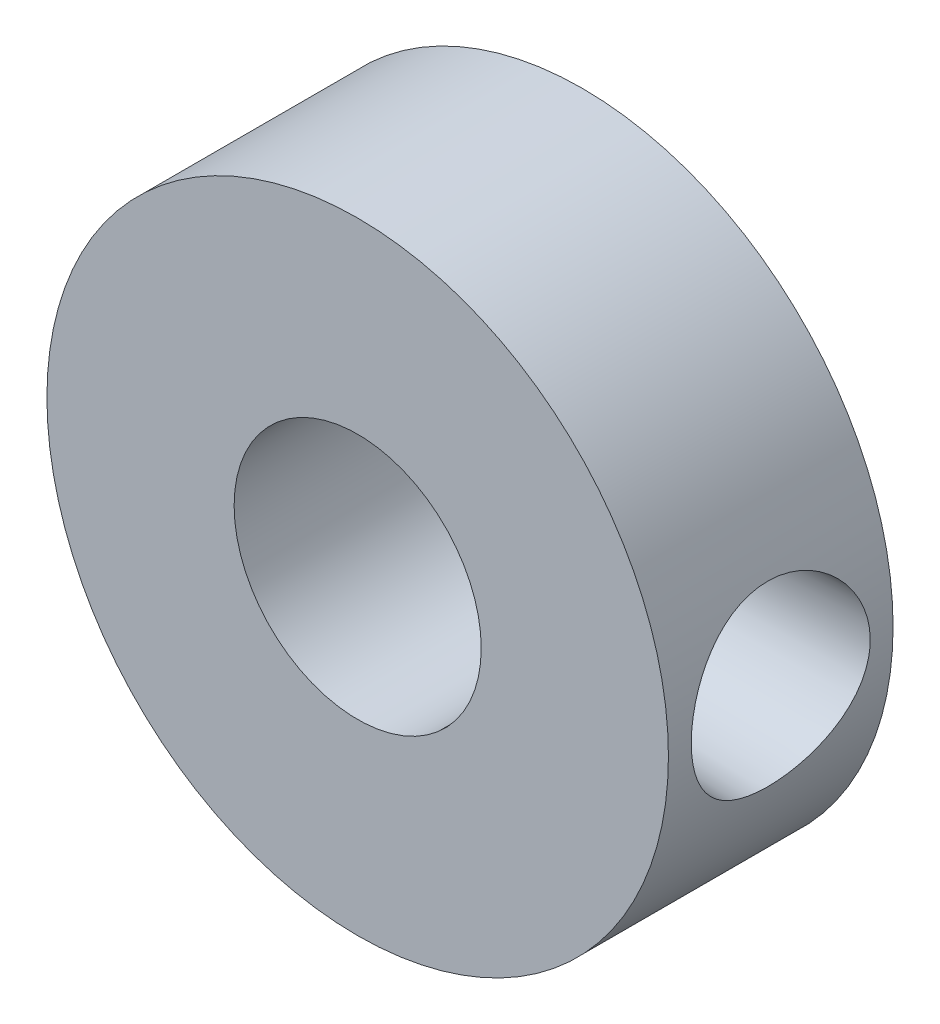
ISO-10303-21;
HEADER;
FILE_DESCRIPTION(('STEP AP214'),'2;1');
FILE_NAME('part.step','',(''),(''),'','','');
FILE_SCHEMA(('AUTOMOTIVE_DESIGN { 1 0 10303 214 1 1 1 1 }'));
ENDSEC;
DATA;
#1=APPLICATION_CONTEXT('core data for automotive mechanical design processes');
#2=APPLICATION_PROTOCOL_DEFINITION('international standard','automotive_design',2000,#1);
#3=PRODUCT_CONTEXT('',#1,'mechanical');
#4=PRODUCT('Part','Part','',(#3));
#5=PRODUCT_RELATED_PRODUCT_CATEGORY('part','',(#4));
#6=PRODUCT_DEFINITION_FORMATION('','',#4);
#7=PRODUCT_DEFINITION_CONTEXT('part definition',#1,'design');
#8=PRODUCT_DEFINITION('design','',#6,#7);
#9=PRODUCT_DEFINITION_SHAPE('','',#8);
#10=(LENGTH_UNIT() NAMED_UNIT(*) SI_UNIT(.MILLI.,.METRE.));
#11=(NAMED_UNIT(*) PLANE_ANGLE_UNIT() SI_UNIT($,.RADIAN.));
#12=(NAMED_UNIT(*) SI_UNIT($,.STERADIAN.) SOLID_ANGLE_UNIT());
#13=UNCERTAINTY_MEASURE_WITH_UNIT(LENGTH_MEASURE(1.E-05),#10,'distance_accuracy_value','');
#14=(GEOMETRIC_REPRESENTATION_CONTEXT(3) GLOBAL_UNCERTAINTY_ASSIGNED_CONTEXT((#13)) GLOBAL_UNIT_ASSIGNED_CONTEXT((#10,
#11,#12)) REPRESENTATION_CONTEXT('',''));
#15=CARTESIAN_POINT('',(0.,0.,0.));
#16=DIRECTION('',(0.,0.,1.));
#17=DIRECTION('',(1.,0.,0.));
#18=AXIS2_PLACEMENT_3D('',#15,#16,#17);
#19=CARTESIAN_POINT('',(0.,0.,7.62));
#20=DIRECTION('',(0.,0.,-1.));
#21=DIRECTION('',(-1.,0.,0.));
#22=AXIS2_PLACEMENT_3D('',#19,#20,#21);
#23=CYLINDRICAL_SURFACE('',#22,10.541);
#24=CARTESIAN_POINT('',(0.,0.,7.62));
#25=DIRECTION('',(0.,0.,1.));
#26=DIRECTION('',(1.,0.,0.));
#27=AXIS2_PLACEMENT_3D('',#24,#25,#26);
#28=CIRCLE('',#27,10.541);
#29=CARTESIAN_POINT('',(10.541,0.,7.62));
#30=VERTEX_POINT('',#29);
#31=EDGE_CURVE('E10',#30,#30,#28,.T.);
#32=ORIENTED_EDGE('',*,*,#31,.F.);
#33=EDGE_LOOP('',(#32));
#34=FACE_BOUND('',#33,.T.);
#35=CARTESIAN_POINT('',(0.,0.,0.));
#36=DIRECTION('',(0.,0.,1.));
#37=DIRECTION('',(1.,0.,0.));
#38=AXIS2_PLACEMENT_3D('',#35,#36,#37);
#39=CIRCLE('',#38,10.541);
#40=CARTESIAN_POINT('',(10.541,0.,0.));
#41=VERTEX_POINT('',#40);
#42=EDGE_CURVE('E43',#41,#41,#39,.T.);
#43=ORIENTED_EDGE('',*,*,#42,.T.);
#44=EDGE_LOOP('',(#43));
#45=FACE_BOUND('',#44,.T.);
#46=CARTESIAN_POINT('',(10.2943697801697,-2.26685505251837,1.80475846003034));
#47=CARTESIAN_POINT('',(10.3189742223447,-2.15511311330983,1.67714498897462));
#48=CARTESIAN_POINT('',(10.3440276256334,-2.03265848856244,1.55895070493733));
#49=CARTESIAN_POINT('',(10.3922921077715,-1.76941567047562,1.34457286810058));
#50=CARTESIAN_POINT('',(10.4155025997836,-1.62862167472425,1.24839630818048));
#51=CARTESIAN_POINT('',(10.4575584097423,-1.33212958960197,1.08078626675329));
#52=CARTESIAN_POINT('',(10.4763981542363,-1.17641282461655,1.00938432028094));
#53=CARTESIAN_POINT('',(10.5075452643558,-0.854558035778706,0.893892689259455));
#54=CARTESIAN_POINT('',(10.5198546395913,-0.688423235517663,0.849794601713849));
#55=CARTESIAN_POINT('',(10.5362897544519,-0.355382027273747,0.791337911320862));
#56=CARTESIAN_POINT('',(10.5406336399666,-0.18862567121073,0.776186071211805));
#57=CARTESIAN_POINT('',(10.5413214173081,0.145094463375428,0.773771925306454));
#58=CARTESIAN_POINT('',(10.537666305359,0.312058213480615,0.786506146479537));
#59=CARTESIAN_POINT('',(10.5229542413894,0.637152614075261,0.838723157801308));
#60=CARTESIAN_POINT('',(10.5120816843074,0.795399526978121,0.877539873984169));
#61=CARTESIAN_POINT('',(10.4842621115381,1.10309229917385,0.979930512204347));
#62=CARTESIAN_POINT('',(10.4673145073544,1.25253730418284,1.04350683278292));
#63=CARTESIAN_POINT('',(10.4286898905323,1.54169481573671,1.19497014070454));
#64=CARTESIAN_POINT('',(10.4069260884867,1.68115683482259,1.28331243391679));
#65=CARTESIAN_POINT('',(10.3611137511975,1.94365284770945,1.48126844393494));
#66=CARTESIAN_POINT('',(10.3370646755664,2.06668293930581,1.59088719830208));
#67=CARTESIAN_POINT('',(10.288241617406,2.29765948991062,1.83310103598513));
#68=CARTESIAN_POINT('',(10.2634743392072,2.40486574103235,1.96640452667282));
#69=CARTESIAN_POINT('',(10.2169076212036,2.59560211351049,2.24947600849442));
#70=CARTESIAN_POINT('',(10.1951082880127,2.67913138446414,2.39924459073463));
#71=CARTESIAN_POINT('',(10.1569539623509,2.82034918142611,2.7119252144389));
#72=CARTESIAN_POINT('',(10.1406212852731,2.87793211517688,2.8748878355422));
#73=CARTESIAN_POINT('',(10.1155660075599,2.96480699761297,3.20873648696618));
#74=CARTESIAN_POINT('',(10.1068413039624,2.99410676444457,3.37962031397947));
#75=CARTESIAN_POINT('',(10.0982738913049,3.02287290755571,3.7183714310582));
#76=CARTESIAN_POINT('',(10.0981459831606,3.02329723393823,3.88615058178612));
#77=CARTESIAN_POINT('',(10.1060682576511,2.9967069946285,4.2193115997228));
#78=CARTESIAN_POINT('',(10.1141179676009,2.96969401487497,4.3846936049316));
#79=CARTESIAN_POINT('',(10.1372470747482,2.8897376153144,4.70604837295859));
#80=CARTESIAN_POINT('',(10.1522266713392,2.83716180717616,4.86212032321689));
#81=CARTESIAN_POINT('',(10.1874725968484,2.70786819223349,5.16327740738764));
#82=CARTESIAN_POINT('',(10.2077398213378,2.63114629532486,5.30836067475852));
#83=CARTESIAN_POINT('',(10.2519979343511,2.45312948390457,5.58794036400235));
#84=CARTESIAN_POINT('',(10.2760789063459,2.35119324171924,5.72201411740275));
#85=CARTESIAN_POINT('',(10.3248901270456,2.12661859882692,5.97142093857054));
#86=CARTESIAN_POINT('',(10.3496204912228,2.00397649494832,6.08675064677622));
#87=CARTESIAN_POINT('',(10.3976632588338,1.7378078294187,6.2981861997034));
#88=CARTESIAN_POINT('',(10.4209266656335,1.59384655252742,6.39375739916312));
#89=CARTESIAN_POINT('',(10.4627345806953,1.29118671718819,6.55914695225844));
#90=CARTESIAN_POINT('',(10.4812798142287,1.13249042891198,6.62896926472126));
#91=CARTESIAN_POINT('',(10.5111985482444,0.808279693615174,6.73931789803493));
#92=CARTESIAN_POINT('',(10.5227134293652,0.642976209373258,6.78042432424843));
#93=CARTESIAN_POINT('',(10.5378513537328,0.307463181982403,6.83414838522542));
#94=CARTESIAN_POINT('',(10.5414764430571,0.13725492240424,6.84677340616666));
#95=CARTESIAN_POINT('',(10.5404410628962,-0.196546273992577,6.843136943602));
#96=CARTESIAN_POINT('',(10.5360799844804,-0.36015259930944,6.82791926548045));
#97=CARTESIAN_POINT('',(10.5201279653136,-0.682359164156327,6.77117425967665));
#98=CARTESIAN_POINT('',(10.5085370435592,-0.840959416838793,6.72964700112353));
#99=CARTESIAN_POINT('',(10.4793603024038,-1.14873628201389,6.6217185210825));
#100=CARTESIAN_POINT('',(10.4617778940512,-1.29791819936135,6.55533145055767));
#101=CARTESIAN_POINT('',(10.4224198381713,-1.5832289847069,6.3996946860754));
#102=CARTESIAN_POINT('',(10.4006433672883,-1.71935528182314,6.31044050183198));
#103=CARTESIAN_POINT('',(10.354257846132,-1.97994502032679,6.10789162661784));
#104=CARTESIAN_POINT('',(10.32957513911,-2.10381376847349,5.99384845613208));
#105=CARTESIAN_POINT('',(10.2806825654794,-2.33104827716676,5.74678230020728));
#106=CARTESIAN_POINT('',(10.2564727874598,-2.43441022896095,5.61375579684399));
#107=CARTESIAN_POINT('',(10.2106230541564,-2.62016377781512,5.32865186418873));
#108=CARTESIAN_POINT('',(10.1890592006079,-2.70198920754312,5.17619220651285));
#109=CARTESIAN_POINT('',(10.1517902245133,-2.83882018282709,4.85901229187338));
#110=CARTESIAN_POINT('',(10.136083952889,-2.89383098924149,4.69429444720369));
#111=CARTESIAN_POINT('',(10.1127596119577,-2.97430826586394,4.360943277982));
#112=CARTESIAN_POINT('',(10.104977076784,-3.0003765536023,4.19246707317513));
#113=CARTESIAN_POINT('',(10.0979060142319,-3.02409344855972,3.85335465728061));
#114=CARTESIAN_POINT('',(10.0986162422268,-3.02174622011256,3.68271876635942));
#115=CARTESIAN_POINT('',(10.1082855206695,-2.98923096898677,3.34954309477678));
#116=CARTESIAN_POINT('',(10.1169976471309,-2.95989570362927,3.18691370174295));
#117=CARTESIAN_POINT('',(10.1412865196074,-2.87556885589385,2.86902469950111));
#118=CARTESIAN_POINT('',(10.1568621382056,-2.82058148711775,2.71376388454691));
#119=CARTESIAN_POINT('',(10.1917132555284,-2.6917897908936,2.42612305641326));
#120=CARTESIAN_POINT('',(10.210613727538,-2.6197504913306,2.29290140964069));
#121=CARTESIAN_POINT('',(10.2510144101301,-2.45691159654217,2.03889431345961));
#122=CARTESIAN_POINT('',(10.2725149842892,-2.36610937640591,1.91811060765094));
#123=CARTESIAN_POINT('',(10.2943697801697,-2.26685505251837,1.80475846003034));
#124=B_SPLINE_CURVE_WITH_KNOTS('',3,(#46,#47,#48,#49,#50,#51,#52,#53,#54,#55,#56,#57,#58,#59,
#60,#61,#62,#63,#64,#65,#66,#67,#68,#69,#70,#71,#72,#73,#74,#75,#76,#77,#78,#79,#80,#81,#82,#83,
#84,#85,#86,#87,#88,#89,#90,#91,#92,#93,#94,#95,#96,#97,#98,#99,#100,#101,#102,#103,#104,#105,
#106,#107,#108,#109,#110,#111,#112,#113,#114,#115,#116,#117,#118,#119,#120,#121,#122,#123),
.UNSPECIFIED.,.T.,.F.,(4,2,2,2,2,2,2,2,2,2,2,2,2,2,2,2,2,2,2,2,2,2,2,2,2,2,2,2,2,2,2,2,2,2,2,2,
2,2,4),(0.,0.513659990936045,1.02748289582443,1.54195745516374,2.05627360174686,
2.55628119759335,3.05622652423261,3.54386675043308,4.03155422764117,4.5288728376462,
5.02630934017792,5.54243163332216,6.05857246160942,6.57679523473542,7.09487471759125,
7.59575810594378,8.09661254374412,8.5904683268675,9.08440780925072,9.59250565418361,
10.1006944671044,10.621220075058,11.1416656200978,11.6512670303382,12.1607362687472,
12.6514956830968,13.142253807968,13.6327330019509,14.12330858248,14.6315085433437,
15.1398028046269,15.6603616084808,16.1808182408623,16.6902373356218,17.1995817752018,
17.6937183634813,18.1877738136929,18.6439663513798,19.100222753135),.UNSPECIFIED.);
#125=CARTESIAN_POINT('',(10.2943697801697,-2.26685505251837,1.80475846003034));
#126=VERTEX_POINT('',#125);
#127=EDGE_CURVE('E53',#126,#126,#124,.T.);
#128=ORIENTED_EDGE('',*,*,#127,.F.);
#129=EDGE_LOOP('',(#128));
#130=FACE_BOUND('',#129,.T.);
#131=ADVANCED_FACE('F31',(#34,#45,#130),#23,.T.);
#132=CARTESIAN_POINT('',(0.,0.,7.62));
#133=DIRECTION('',(0.,0.,-1.));
#134=DIRECTION('',(-1.,0.,0.));
#135=AXIS2_PLACEMENT_3D('',#132,#133,#134);
#136=CYLINDRICAL_SURFACE('',#135,4.191);
#137=CARTESIAN_POINT('',(0.,0.,0.));
#138=DIRECTION('',(0.,0.,1.));
#139=DIRECTION('',(1.,0.,0.));
#140=AXIS2_PLACEMENT_3D('',#137,#138,#139);
#141=CIRCLE('',#140,4.191);
#142=CARTESIAN_POINT('',(4.191,0.,0.));
#143=VERTEX_POINT('',#142);
#144=EDGE_CURVE('E50',#143,#143,#141,.T.);
#145=ORIENTED_EDGE('',*,*,#144,.F.);
#146=EDGE_LOOP('',(#145));
#147=FACE_BOUND('',#146,.T.);
#148=CARTESIAN_POINT('',(0.,0.,7.62));
#149=DIRECTION('',(0.,0.,1.));
#150=DIRECTION('',(1.,0.,0.));
#151=AXIS2_PLACEMENT_3D('',#148,#149,#150);
#152=CIRCLE('',#151,4.191);
#153=CARTESIAN_POINT('',(4.191,0.,7.62));
#154=VERTEX_POINT('',#153);
#155=EDGE_CURVE('E48',#154,#154,#152,.T.);
#156=ORIENTED_EDGE('',*,*,#155,.T.);
#157=EDGE_LOOP('',(#156));
#158=FACE_BOUND('',#157,.T.);
#159=CARTESIAN_POINT('',(3.61003742185174,-2.12887548081858,2.00193394159099));
#160=CARTESIAN_POINT('',(3.66856937075356,-2.02961121432625,1.88190044918812));
#161=CARTESIAN_POINT('',(3.72746508041316,-1.92033640933961,1.77015926333016));
#162=CARTESIAN_POINT('',(3.84046544316424,-1.68304418665844,1.56540793262595));
#163=CARTESIAN_POINT('',(3.89456398645593,-1.55500340316005,1.47242148763565));
#164=CARTESIAN_POINT('',(3.99314871804482,-1.28082307071761,1.3077478142688));
#165=CARTESIAN_POINT('',(4.03756363021122,-1.13456100269882,1.23621715430617));
#166=CARTESIAN_POINT('',(4.09283827542946,-0.905194323080593,1.14860565291865));
#167=CARTESIAN_POINT('',(4.10936973258152,-0.827092849458563,1.12268573247375));
#168=CARTESIAN_POINT('',(4.1381827941638,-0.668166766171726,1.07779353008851));
#169=CARTESIAN_POINT('',(4.1504652664882,-0.58734271632374,1.05881982927281));
#170=CARTESIAN_POINT('',(4.17762359298222,-0.363672520989815,1.01700548430128));
#171=CARTESIAN_POINT('',(4.18780766792357,-0.21876621182297,1.00151461738448));
#172=CARTESIAN_POINT('',(4.19290440512793,0.071833785959231,0.993743264131596));
#173=CARTESIAN_POINT('',(4.18782385559915,0.217527095829084,1.00145246068461));
#174=CARTESIAN_POINT('',(4.16431259135293,0.489550208565064,1.03747695133037));
#175=CARTESIAN_POINT('',(4.14733182937849,0.616312967516839,1.06355567826086));
#176=CARTESIAN_POINT('',(4.10305069593952,0.863251897542343,1.13251536161369));
#177=CARTESIAN_POINT('',(4.07574864623691,0.98342699382371,1.17539905055899));
#178=CARTESIAN_POINT('',(4.01104778356532,1.22149825463411,1.27911214163714));
#179=CARTESIAN_POINT('',(3.97316171992878,1.33887306489699,1.34082594201829));
#180=CARTESIAN_POINT('',(3.8908601078598,1.5620034772463,1.47901700471564));
#181=CARTESIAN_POINT('',(3.84644234297834,1.6677551137875,1.55549928129425));
#182=CARTESIAN_POINT('',(3.74663742856841,1.88236585473831,1.73464980899487));
#183=CARTESIAN_POINT('',(3.6906257565772,1.98907798062775,1.8395460053485));
#184=CARTESIAN_POINT('',(3.57836819446239,2.18460756641671,2.06504118297247));
#185=CARTESIAN_POINT('',(3.52212206100619,2.27339016294124,2.18567002070425));
#186=CARTESIAN_POINT('',(3.4083353761736,2.44114159283899,2.45683667619384));
#187=CARTESIAN_POINT('',(3.35145273467715,2.51764590523796,2.60922676590726));
#188=CARTESIAN_POINT('',(3.27800354809934,2.61166049737474,2.84918180347013));
#189=CARTESIAN_POINT('',(3.25551385275883,2.63952665467899,2.93098665386982));
#190=CARTESIAN_POINT('',(3.21566339934654,2.68792949135545,3.09792195517766));
#191=CARTESIAN_POINT('',(3.19829947365988,2.70847069902782,3.1830503152408));
#192=CARTESIAN_POINT('',(3.16442050779618,2.74806744316692,3.38883181043465));
#193=CARTESIAN_POINT('',(3.15074084623611,2.76358563868296,3.51068049512779));
#194=CARTESIAN_POINT('',(3.13737674816041,2.77875151282385,3.75602738581313));
#195=CARTESIAN_POINT('',(3.13767933667656,2.77841390499457,3.87952395622552));
#196=CARTESIAN_POINT('',(3.15218122878973,2.7619451181866,4.12442182177861));
#197=CARTESIAN_POINT('',(3.16636127407358,2.74583582620564,4.24582578334148));
#198=CARTESIAN_POINT('',(3.20654026299526,2.69879914241635,4.48375097048113));
#199=CARTESIAN_POINT('',(3.23255526004215,2.66785162034497,4.60026532836195));
#200=CARTESIAN_POINT('',(3.30301570171553,2.58043016924844,4.86238251002318));
#201=CARTESIAN_POINT('',(3.35069164500361,2.51896727176858,5.00544451827369));
#202=CARTESIAN_POINT('',(3.45415089030843,2.37511507826671,5.27745292438078));
#203=CARTESIAN_POINT('',(3.5099469320784,2.29269274391602,5.40637657244664));
#204=CARTESIAN_POINT('',(3.62439469787123,2.10720459003885,5.65052957875044));
#205=CARTESIAN_POINT('',(3.68307710128708,2.00384144868015,5.76551848398663));
#206=CARTESIAN_POINT('',(3.79697912595989,1.77857614783756,5.97754888316826));
#207=CARTESIAN_POINT('',(3.85220204044802,1.65669200996698,6.07460762258746));
#208=CARTESIAN_POINT('',(3.94884536623525,1.40954330395104,6.23904808266932));
#209=CARTESIAN_POINT('',(3.9911061232346,1.28597634474072,6.30847546180882));
#210=CARTESIAN_POINT('',(4.06543078681883,1.0270599832798,6.42835085476421));
#211=CARTESIAN_POINT('',(4.09749986397252,0.891716600128004,6.47880849492733));
#212=CARTESIAN_POINT('',(4.14860622976699,0.611499536989935,6.55845836379913));
#213=CARTESIAN_POINT('',(4.16755948452374,0.466570803441726,6.58751354062509));
#214=CARTESIAN_POINT('',(4.19002256955823,0.172761873859605,6.6218941170465));
#215=CARTESIAN_POINT('',(4.19354174327727,0.0238841234100059,6.62723387344242));
#216=CARTESIAN_POINT('',(4.18526488566786,-0.255791451237367,6.61460253163587));
#217=CARTESIAN_POINT('',(4.17512400295129,-0.386763346795518,6.59915089501053));
#218=CARTESIAN_POINT('',(4.14328270826244,-0.64378688894081,6.55011664824165));
#219=CARTESIAN_POINT('',(4.12158097590521,-0.769837971747977,6.51653196708529));
#220=CARTESIAN_POINT('',(4.06805800009372,-1.01558644895442,6.43230780690067));
#221=CARTESIAN_POINT('',(4.03611376067528,-1.13518483297265,6.38146057172026));
#222=CARTESIAN_POINT('',(3.96455229828928,-1.36426843204457,6.26475809760459));
#223=CARTESIAN_POINT('',(3.92493328484054,-1.47375127838077,6.19889935593558));
#224=CARTESIAN_POINT('',(3.83470580753666,-1.69581749394035,6.04385561091536));
#225=CARTESIAN_POINT('',(3.78333529357943,-1.80671244583898,5.95269996843071));
#226=CARTESIAN_POINT('',(3.67787309269119,-2.01275002069393,5.75517343963969));
#227=CARTESIAN_POINT('',(3.62377727600754,-2.10786773892116,5.64877898261009));
#228=CARTESIAN_POINT('',(3.50903544322916,-2.29453387867339,5.40490166728037));
#229=CARTESIAN_POINT('',(3.44865389945239,-2.38330852934577,5.26515291907053));
#230=CARTESIAN_POINT('',(3.33785713603259,-2.53616216095134,4.96918068014689));
#231=CARTESIAN_POINT('',(3.28742422090689,-2.60028518578198,4.81298721270864));
#232=CARTESIAN_POINT('',(3.2168222595651,-2.68677473187734,4.53194757984812));
#233=CARTESIAN_POINT('',(3.19214496973572,-2.71577413829521,4.41028590588892));
#234=CARTESIAN_POINT('',(3.15607159503925,-2.75762246365187,4.16237418799447));
#235=CARTESIAN_POINT('',(3.14465405910798,-2.77049747060906,4.03613189661136));
#236=CARTESIAN_POINT('',(3.13686631499843,-2.77931566596598,3.78219070226993));
#237=CARTESIAN_POINT('',(3.14054152214591,-2.77520775108478,3.65448855778355));
#238=CARTESIAN_POINT('',(3.16243047330975,-2.75023050999619,3.4019421511981));
#239=CARTESIAN_POINT('',(3.18065954607304,-2.72934351120425,3.27710104515592));
#240=CARTESIAN_POINT('',(3.22826912204463,-2.67283751739085,3.03689605588558));
#241=CARTESIAN_POINT('',(3.25732995092917,-2.63763843443116,2.92136612728981));
#242=CARTESIAN_POINT('',(3.32336672696369,-2.55392734467668,2.69774694724192));
#243=CARTESIAN_POINT('',(3.36034087086741,-2.50541837016373,2.58965600803412));
#244=CARTESIAN_POINT('',(3.43249583808131,-2.4053269617145,2.39911693127351));
#245=CARTESIAN_POINT('',(3.46694738436294,-2.3556062600062,2.31539860947564));
#246=CARTESIAN_POINT('',(3.53756479040539,-2.24816753964451,2.15403354738885));
#247=CARTESIAN_POINT('',(3.57373112777459,-2.19044728422235,2.07638851479503));
#248=CARTESIAN_POINT('',(3.61003742185174,-2.12887548081858,2.00193394159099));
#249=B_SPLINE_CURVE_WITH_KNOTS('',3,(#159,#160,#161,#162,#163,#164,#165,#166,#167,#168,#169,
#170,#171,#172,#173,#174,#175,#176,#177,#178,#179,#180,#181,#182,#183,#184,#185,#186,#187,#188,
#189,#190,#191,#192,#193,#194,#195,#196,#197,#198,#199,#200,#201,#202,#203,#204,#205,#206,#207,
#208,#209,#210,#211,#212,#213,#214,#215,#216,#217,#218,#219,#220,#221,#222,#223,#224,#225,#226,
#227,#228,#229,#230,#231,#232,#233,#234,#235,#236,#237,#238,#239,#240,#241,#242,#243,#244,#245,
#246,#247,#248),.UNSPECIFIED.,.T.,.F.,(4,2,2,2,2,2,2,2,2,2,2,2,2,2,2,2,2,2,2,2,2,2,2,2,2,2,2,2,
2,2,2,2,2,2,2,2,2,2,2,2,2,2,2,2,4),(0.,0.498852193662884,0.998330877267293,1.50137035504722,
1.75279116514849,2.00416058987502,2.43967760800896,2.87500097954757,3.26485179831453,
3.65476603398328,4.06692992425875,4.47923400119722,4.95665456443175,5.43499470232199,
5.97086466596031,6.23834046292513,6.50565061792032,6.8746423291055,7.24329163763955,
7.6114300808666,7.98006937783848,8.4660059535383,8.95271331053252,9.44688799514949,
9.94058487273547,10.3824624741195,10.8241155375029,11.2685727337652,11.7127608285861,
12.1076892576243,12.5026628018062,12.9025691013153,13.3025688092953,13.7582280252069,
14.2145998023236,14.7408112339744,15.2660780901063,15.6469652444995,16.0272353537622,
16.4086505647278,16.7904680291273,17.1618098856799,17.5330672126512,17.8424094055825,
18.1518382693734),.UNSPECIFIED.);
#250=CARTESIAN_POINT('',(3.61003742185174,-2.12887548081858,2.00193394159099));
#251=VERTEX_POINT('',#250);
#252=EDGE_CURVE('E35',#251,#251,#249,.T.);
#253=ORIENTED_EDGE('',*,*,#252,.T.);
#254=EDGE_LOOP('',(#253));
#255=FACE_BOUND('',#254,.T.);
#256=ADVANCED_FACE('F64',(#147,#158,#255),#136,.F.);
#257=CARTESIAN_POINT('',(0.,0.,7.62));
#258=DIRECTION('',(0.,0.,1.));
#259=DIRECTION('',(1.,0.,0.));
#260=AXIS2_PLACEMENT_3D('',#257,#258,#259);
#261=PLANE('',#260);
#262=ORIENTED_EDGE('',*,*,#31,.T.);
#263=EDGE_LOOP('',(#262));
#264=FACE_BOUND('',#263,.T.);
#265=ORIENTED_EDGE('',*,*,#155,.F.);
#266=EDGE_LOOP('',(#265));
#267=FACE_BOUND('',#266,.T.);
#268=ADVANCED_FACE('F69',(#264,#267),#261,.T.);
#269=CARTESIAN_POINT('',(0.,0.,0.));
#270=DIRECTION('',(0.,0.,1.));
#271=DIRECTION('',(1.,0.,0.));
#272=AXIS2_PLACEMENT_3D('',#269,#270,#271);
#273=PLANE('',#272);
#274=ORIENTED_EDGE('',*,*,#42,.F.);
#275=EDGE_LOOP('',(#274));
#276=FACE_BOUND('',#275,.T.);
#277=ORIENTED_EDGE('',*,*,#144,.T.);
#278=EDGE_LOOP('',(#277));
#279=FACE_BOUND('',#278,.T.);
#280=ADVANCED_FACE('F62',(#276,#279),#273,.F.);
#281=CARTESIAN_POINT('',(0.,0.,3.81));
#282=DIRECTION('',(1.,0.,0.));
#283=DIRECTION('',(0.,0.,-1.));
#284=AXIS2_PLACEMENT_3D('',#281,#282,#283);
#285=CONICAL_SURFACE('',#284,2.667,0.0349065850398867);
#286=ORIENTED_EDGE('',*,*,#252,.F.);
#287=EDGE_LOOP('',(#286));
#288=FACE_BOUND('',#287,.T.);
#289=ORIENTED_EDGE('',*,*,#127,.T.);
#290=EDGE_LOOP('',(#289));
#291=FACE_BOUND('',#290,.T.);
#292=ADVANCED_FACE('F59',(#288,#291),#285,.F.);
#293=CLOSED_SHELL('',(#131,#256,#268,#280,#292));
#294=MANIFOLD_SOLID_BREP('B2',#293);
#295=ADVANCED_BREP_SHAPE_REPRESENTATION('',(#18,#294),#14);
#296=SHAPE_DEFINITION_REPRESENTATION(#9,#295);
ENDSEC;
END-ISO-10303-21;
